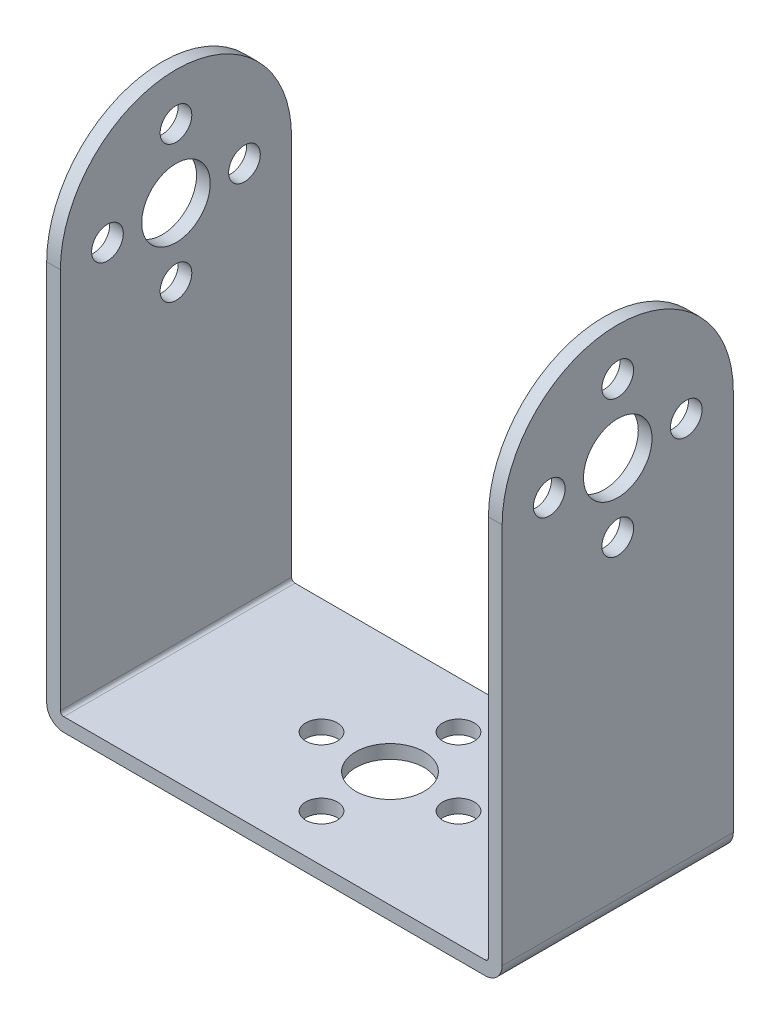
ISO-10303-21;
HEADER;
FILE_DESCRIPTION(('STEP AP214'),'2;1');
FILE_NAME('part.step','',(''),(''),'','','');
FILE_SCHEMA(('AUTOMOTIVE_DESIGN { 1 0 10303 214 1 1 1 1 }'));
ENDSEC;
DATA;
#1=APPLICATION_CONTEXT('core data for automotive mechanical design processes');
#2=APPLICATION_PROTOCOL_DEFINITION('international standard','automotive_design',2000,#1);
#3=PRODUCT_CONTEXT('',#1,'mechanical');
#4=PRODUCT('Part','Part','',(#3));
#5=PRODUCT_RELATED_PRODUCT_CATEGORY('part','',(#4));
#6=PRODUCT_DEFINITION_FORMATION('','',#4);
#7=PRODUCT_DEFINITION_CONTEXT('part definition',#1,'design');
#8=PRODUCT_DEFINITION('design','',#6,#7);
#9=PRODUCT_DEFINITION_SHAPE('','',#8);
#10=(LENGTH_UNIT() NAMED_UNIT(*) SI_UNIT(.MILLI.,.METRE.));
#11=(NAMED_UNIT(*) PLANE_ANGLE_UNIT() SI_UNIT($,.RADIAN.));
#12=(NAMED_UNIT(*) SI_UNIT($,.STERADIAN.) SOLID_ANGLE_UNIT());
#13=UNCERTAINTY_MEASURE_WITH_UNIT(LENGTH_MEASURE(1.E-05),#10,'distance_accuracy_value','');
#14=(GEOMETRIC_REPRESENTATION_CONTEXT(3) GLOBAL_UNCERTAINTY_ASSIGNED_CONTEXT((#13)) GLOBAL_UNIT_ASSIGNED_CONTEXT((#10,
#11,#12)) REPRESENTATION_CONTEXT('',''));
#15=CARTESIAN_POINT('',(0.,0.,0.));
#16=DIRECTION('',(0.,0.,1.));
#17=DIRECTION('',(1.,0.,0.));
#18=AXIS2_PLACEMENT_3D('',#15,#16,#17);
#19=CARTESIAN_POINT('',(-24.6,0.4,-48.6972));
#20=DIRECTION('',(0.,0.,1.));
#21=DIRECTION('',(1.,0.,0.));
#22=AXIS2_PLACEMENT_3D('',#19,#20,#21);
#23=CYLINDRICAL_SURFACE('',#22,0.4);
#24=CARTESIAN_POINT('',(-24.6,0.4,13.5));
#25=DIRECTION('',(0.,0.,1.));
#26=DIRECTION('',(1.,0.,0.));
#27=AXIS2_PLACEMENT_3D('',#24,#25,#26);
#28=CIRCLE('',#27,0.4);
#29=CARTESIAN_POINT('',(-24.6,0.,13.5));
#30=VERTEX_POINT('',#29);
#31=CARTESIAN_POINT('',(-25.,0.4,13.5));
#32=VERTEX_POINT('',#31);
#33=EDGE_CURVE('E114',#30,#32,#28,.F.);
#34=ORIENTED_EDGE('',*,*,#33,.F.);
#35=DIRECTION('',(0.,0.,1.));
#36=VECTOR('',#35,1.);
#37=CARTESIAN_POINT('',(-24.6,0.,-13.5));
#38=LINE('',#37,#36);
#39=CARTESIAN_POINT('',(-24.6,0.,-13.5));
#40=VERTEX_POINT('',#39);
#41=EDGE_CURVE('E116',#40,#30,#38,.T.);
#42=ORIENTED_EDGE('',*,*,#41,.F.);
#43=CARTESIAN_POINT('',(-24.6,0.4,-13.5));
#44=DIRECTION('',(0.,0.,1.));
#45=DIRECTION('',(1.,0.,0.));
#46=AXIS2_PLACEMENT_3D('',#43,#44,#45);
#47=CIRCLE('',#46,0.4);
#48=CARTESIAN_POINT('',(-25.,0.4,-13.5));
#49=VERTEX_POINT('',#48);
#50=EDGE_CURVE('E20',#49,#40,#47,.T.);
#51=ORIENTED_EDGE('',*,*,#50,.F.);
#52=DIRECTION('',(0.,0.,-1.));
#53=VECTOR('',#52,1.);
#54=CARTESIAN_POINT('',(-25.,0.4,-13.5));
#55=LINE('',#54,#53);
#56=EDGE_CURVE('E143',#32,#49,#55,.T.);
#57=ORIENTED_EDGE('',*,*,#56,.F.);
#58=EDGE_LOOP('',(#34,#42,#51,#57));
#59=FACE_BOUND('',#58,.T.);
#60=ADVANCED_FACE('F17',(#59),#23,.F.);
#61=CARTESIAN_POINT('',(95.95152,45.,0.));
#62=DIRECTION('',(-1.,0.,0.));
#63=DIRECTION('',(0.,0.,1.));
#64=AXIS2_PLACEMENT_3D('',#61,#62,#63);
#65=CYLINDRICAL_SURFACE('',#64,13.5);
#66=CARTESIAN_POINT('',(-25.,45.,0.));
#67=DIRECTION('',(-1.,0.,0.));
#68=DIRECTION('',(0.,0.,1.));
#69=AXIS2_PLACEMENT_3D('',#66,#67,#68);
#70=CIRCLE('',#69,13.5);
#71=CARTESIAN_POINT('',(-25.,45.,-13.5));
#72=VERTEX_POINT('',#71);
#73=CARTESIAN_POINT('',(-25.,45.,13.5));
#74=VERTEX_POINT('',#73);
#75=EDGE_CURVE('E145',#72,#74,#70,.F.);
#76=ORIENTED_EDGE('',*,*,#75,.F.);
#77=DIRECTION('',(-1.,0.,0.));
#78=VECTOR('',#77,1.);
#79=CARTESIAN_POINT('',(95.95152,45.,-13.5));
#80=LINE('',#79,#78);
#81=CARTESIAN_POINT('',(-26.6,45.,-13.5));
#82=VERTEX_POINT('',#81);
#83=EDGE_CURVE('E155',#72,#82,#80,.T.);
#84=ORIENTED_EDGE('',*,*,#83,.T.);
#85=CARTESIAN_POINT('',(-26.6,45.,0.));
#86=DIRECTION('',(-1.,0.,0.));
#87=DIRECTION('',(0.,0.,1.));
#88=AXIS2_PLACEMENT_3D('',#85,#86,#87);
#89=CIRCLE('',#88,13.5);
#90=CARTESIAN_POINT('',(-26.6,45.,13.5));
#91=VERTEX_POINT('',#90);
#92=EDGE_CURVE('E235',#91,#82,#89,.T.);
#93=ORIENTED_EDGE('',*,*,#92,.F.);
#94=DIRECTION('',(-1.,0.,0.));
#95=VECTOR('',#94,1.);
#96=CARTESIAN_POINT('',(95.95152,45.,13.5));
#97=LINE('',#96,#95);
#98=EDGE_CURVE('E158',#91,#74,#97,.F.);
#99=ORIENTED_EDGE('',*,*,#98,.T.);
#100=EDGE_LOOP('',(#76,#84,#93,#99));
#101=FACE_BOUND('',#100,.T.);
#102=ADVANCED_FACE('F429',(#101),#65,.T.);
#103=CARTESIAN_POINT('',(-31.92,45.,0.));
#104=DIRECTION('',(1.,0.,0.));
#105=DIRECTION('',(0.,0.,-1.));
#106=AXIS2_PLACEMENT_3D('',#103,#104,#105);
#107=CYLINDRICAL_SURFACE('',#106,4.);
#108=CARTESIAN_POINT('',(-25.,45.,0.));
#109=DIRECTION('',(1.,0.,0.));
#110=DIRECTION('',(0.,0.,-1.));
#111=AXIS2_PLACEMENT_3D('',#108,#109,#110);
#112=CIRCLE('',#111,4.);
#113=CARTESIAN_POINT('',(-25.,45.,-4.));
#114=VERTEX_POINT('',#113);
#115=EDGE_CURVE('E250',#114,#114,#112,.F.);
#116=ORIENTED_EDGE('',*,*,#115,.F.);
#117=EDGE_LOOP('',(#116));
#118=FACE_BOUND('',#117,.T.);
#119=CARTESIAN_POINT('',(-26.6,45.,0.));
#120=DIRECTION('',(1.,0.,0.));
#121=DIRECTION('',(0.,0.,-1.));
#122=AXIS2_PLACEMENT_3D('',#119,#120,#121);
#123=CIRCLE('',#122,4.);
#124=CARTESIAN_POINT('',(-26.6,45.,-4.));
#125=VERTEX_POINT('',#124);
#126=EDGE_CURVE('E232',#125,#125,#123,.T.);
#127=ORIENTED_EDGE('',*,*,#126,.F.);
#128=EDGE_LOOP('',(#127));
#129=FACE_BOUND('',#128,.T.);
#130=ADVANCED_FACE('F426',(#118,#129),#107,.F.);
#131=CARTESIAN_POINT('',(-31.92,53.,0.));
#132=DIRECTION('',(1.,0.,0.));
#133=DIRECTION('',(0.,0.,-1.));
#134=AXIS2_PLACEMENT_3D('',#131,#132,#133);
#135=CYLINDRICAL_SURFACE('',#134,1.85);
#136=CARTESIAN_POINT('',(-25.,53.,0.));
#137=DIRECTION('',(1.,0.,0.));
#138=DIRECTION('',(0.,0.,-1.));
#139=AXIS2_PLACEMENT_3D('',#136,#137,#138);
#140=CIRCLE('',#139,1.85);
#141=CARTESIAN_POINT('',(-25.,53.,-1.85));
#142=VERTEX_POINT('',#141);
#143=EDGE_CURVE('E247',#142,#142,#140,.F.);
#144=ORIENTED_EDGE('',*,*,#143,.F.);
#145=EDGE_LOOP('',(#144));
#146=FACE_BOUND('',#145,.T.);
#147=CARTESIAN_POINT('',(-26.6,53.,0.));
#148=DIRECTION('',(1.,0.,0.));
#149=DIRECTION('',(0.,0.,-1.));
#150=AXIS2_PLACEMENT_3D('',#147,#148,#149);
#151=CIRCLE('',#150,1.85);
#152=CARTESIAN_POINT('',(-26.6,53.,-1.85));
#153=VERTEX_POINT('',#152);
#154=EDGE_CURVE('E229',#153,#153,#151,.T.);
#155=ORIENTED_EDGE('',*,*,#154,.F.);
#156=EDGE_LOOP('',(#155));
#157=FACE_BOUND('',#156,.T.);
#158=ADVANCED_FACE('F422',(#146,#157),#135,.F.);
#159=CARTESIAN_POINT('',(-31.92,45.,-8.));
#160=DIRECTION('',(1.,0.,0.));
#161=DIRECTION('',(0.,0.,-1.));
#162=AXIS2_PLACEMENT_3D('',#159,#160,#161);
#163=CYLINDRICAL_SURFACE('',#162,1.85);
#164=CARTESIAN_POINT('',(-25.,45.,-8.));
#165=DIRECTION('',(1.,0.,0.));
#166=DIRECTION('',(0.,0.,-1.));
#167=AXIS2_PLACEMENT_3D('',#164,#165,#166);
#168=CIRCLE('',#167,1.85);
#169=CARTESIAN_POINT('',(-25.,45.,-9.85));
#170=VERTEX_POINT('',#169);
#171=EDGE_CURVE('E244',#170,#170,#168,.F.);
#172=ORIENTED_EDGE('',*,*,#171,.F.);
#173=EDGE_LOOP('',(#172));
#174=FACE_BOUND('',#173,.T.);
#175=CARTESIAN_POINT('',(-26.6,45.,-8.));
#176=DIRECTION('',(1.,0.,0.));
#177=DIRECTION('',(0.,0.,-1.));
#178=AXIS2_PLACEMENT_3D('',#175,#176,#177);
#179=CIRCLE('',#178,1.85);
#180=CARTESIAN_POINT('',(-26.6,45.,-9.85));
#181=VERTEX_POINT('',#180);
#182=EDGE_CURVE('E226',#181,#181,#179,.T.);
#183=ORIENTED_EDGE('',*,*,#182,.F.);
#184=EDGE_LOOP('',(#183));
#185=FACE_BOUND('',#184,.T.);
#186=ADVANCED_FACE('F418',(#174,#185),#163,.F.);
#187=CARTESIAN_POINT('',(-31.92,37.,0.));
#188=DIRECTION('',(1.,0.,0.));
#189=DIRECTION('',(0.,0.,-1.));
#190=AXIS2_PLACEMENT_3D('',#187,#188,#189);
#191=CYLINDRICAL_SURFACE('',#190,1.85);
#192=CARTESIAN_POINT('',(-25.,37.,0.));
#193=DIRECTION('',(1.,0.,0.));
#194=DIRECTION('',(0.,0.,-1.));
#195=AXIS2_PLACEMENT_3D('',#192,#193,#194);
#196=CIRCLE('',#195,1.85);
#197=CARTESIAN_POINT('',(-25.,37.,-1.85));
#198=VERTEX_POINT('',#197);
#199=EDGE_CURVE('E241',#198,#198,#196,.F.);
#200=ORIENTED_EDGE('',*,*,#199,.F.);
#201=EDGE_LOOP('',(#200));
#202=FACE_BOUND('',#201,.T.);
#203=CARTESIAN_POINT('',(-26.6,37.,0.));
#204=DIRECTION('',(1.,0.,0.));
#205=DIRECTION('',(0.,0.,-1.));
#206=AXIS2_PLACEMENT_3D('',#203,#204,#205);
#207=CIRCLE('',#206,1.85);
#208=CARTESIAN_POINT('',(-26.6,37.,-1.85));
#209=VERTEX_POINT('',#208);
#210=EDGE_CURVE('E223',#209,#209,#207,.T.);
#211=ORIENTED_EDGE('',*,*,#210,.F.);
#212=EDGE_LOOP('',(#211));
#213=FACE_BOUND('',#212,.T.);
#214=ADVANCED_FACE('F414',(#202,#213),#191,.F.);
#215=CARTESIAN_POINT('',(-31.92,45.,8.));
#216=DIRECTION('',(1.,0.,0.));
#217=DIRECTION('',(0.,0.,-1.));
#218=AXIS2_PLACEMENT_3D('',#215,#216,#217);
#219=CYLINDRICAL_SURFACE('',#218,1.85);
#220=CARTESIAN_POINT('',(-25.,45.,8.));
#221=DIRECTION('',(1.,0.,0.));
#222=DIRECTION('',(0.,0.,-1.));
#223=AXIS2_PLACEMENT_3D('',#220,#221,#222);
#224=CIRCLE('',#223,1.85);
#225=CARTESIAN_POINT('',(-25.,45.,6.15));
#226=VERTEX_POINT('',#225);
#227=EDGE_CURVE('E238',#226,#226,#224,.F.);
#228=ORIENTED_EDGE('',*,*,#227,.F.);
#229=EDGE_LOOP('',(#228));
#230=FACE_BOUND('',#229,.T.);
#231=CARTESIAN_POINT('',(-26.6,45.,8.));
#232=DIRECTION('',(1.,0.,0.));
#233=DIRECTION('',(0.,0.,-1.));
#234=AXIS2_PLACEMENT_3D('',#231,#232,#233);
#235=CIRCLE('',#234,1.85);
#236=CARTESIAN_POINT('',(-26.6,45.,6.15));
#237=VERTEX_POINT('',#236);
#238=EDGE_CURVE('E142',#237,#237,#235,.T.);
#239=ORIENTED_EDGE('',*,*,#238,.F.);
#240=EDGE_LOOP('',(#239));
#241=FACE_BOUND('',#240,.T.);
#242=ADVANCED_FACE('F410',(#230,#241),#219,.F.);
#243=CARTESIAN_POINT('',(0.,0.,0.));
#244=DIRECTION('',(0.,1.,0.));
#245=DIRECTION('',(0.,0.,1.));
#246=AXIS2_PLACEMENT_3D('',#243,#244,#245);
#247=CYLINDRICAL_SURFACE('',#246,4.);
#248=CARTESIAN_POINT('',(0.,-1.6,0.));
#249=DIRECTION('',(0.,1.,0.));
#250=DIRECTION('',(0.,0.,1.));
#251=AXIS2_PLACEMENT_3D('',#248,#249,#250);
#252=CIRCLE('',#251,4.);
#253=CARTESIAN_POINT('',(0.,-1.6,4.));
#254=VERTEX_POINT('',#253);
#255=EDGE_CURVE('E138',#254,#254,#252,.T.);
#256=ORIENTED_EDGE('',*,*,#255,.F.);
#257=EDGE_LOOP('',(#256));
#258=FACE_BOUND('',#257,.T.);
#259=CARTESIAN_POINT('',(0.,0.,0.));
#260=DIRECTION('',(0.,1.,0.));
#261=DIRECTION('',(0.,0.,1.));
#262=AXIS2_PLACEMENT_3D('',#259,#260,#261);
#263=CIRCLE('',#262,4.);
#264=CARTESIAN_POINT('',(0.,0.,4.));
#265=VERTEX_POINT('',#264);
#266=EDGE_CURVE('E147',#265,#265,#263,.F.);
#267=ORIENTED_EDGE('',*,*,#266,.F.);
#268=EDGE_LOOP('',(#267));
#269=FACE_BOUND('',#268,.T.);
#270=ADVANCED_FACE('F406',(#258,#269),#247,.F.);
#271=CARTESIAN_POINT('',(0.,0.,-8.));
#272=DIRECTION('',(0.,1.,0.));
#273=DIRECTION('',(0.,0.,1.));
#274=AXIS2_PLACEMENT_3D('',#271,#272,#273);
#275=CYLINDRICAL_SURFACE('',#274,1.85);
#276=CARTESIAN_POINT('',(0.,-1.6,-8.));
#277=DIRECTION('',(0.,1.,0.));
#278=DIRECTION('',(0.,0.,1.));
#279=AXIS2_PLACEMENT_3D('',#276,#277,#278);
#280=CIRCLE('',#279,1.85);
#281=CARTESIAN_POINT('',(0.,-1.6,-6.15));
#282=VERTEX_POINT('',#281);
#283=EDGE_CURVE('E216',#282,#282,#280,.T.);
#284=ORIENTED_EDGE('',*,*,#283,.F.);
#285=EDGE_LOOP('',(#284));
#286=FACE_BOUND('',#285,.T.);
#287=CARTESIAN_POINT('',(0.,0.,-8.));
#288=DIRECTION('',(0.,1.,0.));
#289=DIRECTION('',(0.,0.,1.));
#290=AXIS2_PLACEMENT_3D('',#287,#288,#289);
#291=CIRCLE('',#290,1.85);
#292=CARTESIAN_POINT('',(0.,0.,-6.15));
#293=VERTEX_POINT('',#292);
#294=EDGE_CURVE('E263',#293,#293,#291,.F.);
#295=ORIENTED_EDGE('',*,*,#294,.F.);
#296=EDGE_LOOP('',(#295));
#297=FACE_BOUND('',#296,.T.);
#298=ADVANCED_FACE('F402',(#286,#297),#275,.F.);
#299=CARTESIAN_POINT('',(8.,0.,0.));
#300=DIRECTION('',(0.,1.,0.));
#301=DIRECTION('',(0.,0.,1.));
#302=AXIS2_PLACEMENT_3D('',#299,#300,#301);
#303=CYLINDRICAL_SURFACE('',#302,1.85);
#304=CARTESIAN_POINT('',(8.,-1.6,0.));
#305=DIRECTION('',(0.,1.,0.));
#306=DIRECTION('',(0.,0.,1.));
#307=AXIS2_PLACEMENT_3D('',#304,#305,#306);
#308=CIRCLE('',#307,1.85);
#309=CARTESIAN_POINT('',(8.,-1.6,1.85));
#310=VERTEX_POINT('',#309);
#311=EDGE_CURVE('E213',#310,#310,#308,.T.);
#312=ORIENTED_EDGE('',*,*,#311,.F.);
#313=EDGE_LOOP('',(#312));
#314=FACE_BOUND('',#313,.T.);
#315=CARTESIAN_POINT('',(8.,0.,0.));
#316=DIRECTION('',(0.,1.,0.));
#317=DIRECTION('',(0.,0.,1.));
#318=AXIS2_PLACEMENT_3D('',#315,#316,#317);
#319=CIRCLE('',#318,1.85);
#320=CARTESIAN_POINT('',(8.,0.,1.85));
#321=VERTEX_POINT('',#320);
#322=EDGE_CURVE('E260',#321,#321,#319,.F.);
#323=ORIENTED_EDGE('',*,*,#322,.F.);
#324=EDGE_LOOP('',(#323));
#325=FACE_BOUND('',#324,.T.);
#326=ADVANCED_FACE('F398',(#314,#325),#303,.F.);
#327=CARTESIAN_POINT('',(0.,0.,8.));
#328=DIRECTION('',(0.,1.,0.));
#329=DIRECTION('',(0.,0.,1.));
#330=AXIS2_PLACEMENT_3D('',#327,#328,#329);
#331=CYLINDRICAL_SURFACE('',#330,1.85);
#332=CARTESIAN_POINT('',(0.,-1.6,8.));
#333=DIRECTION('',(0.,1.,0.));
#334=DIRECTION('',(0.,0.,1.));
#335=AXIS2_PLACEMENT_3D('',#332,#333,#334);
#336=CIRCLE('',#335,1.85);
#337=CARTESIAN_POINT('',(0.,-1.6,9.85));
#338=VERTEX_POINT('',#337);
#339=EDGE_CURVE('E210',#338,#338,#336,.T.);
#340=ORIENTED_EDGE('',*,*,#339,.F.);
#341=EDGE_LOOP('',(#340));
#342=FACE_BOUND('',#341,.T.);
#343=CARTESIAN_POINT('',(0.,0.,8.));
#344=DIRECTION('',(0.,1.,0.));
#345=DIRECTION('',(0.,0.,1.));
#346=AXIS2_PLACEMENT_3D('',#343,#344,#345);
#347=CIRCLE('',#346,1.85);
#348=CARTESIAN_POINT('',(0.,0.,9.85));
#349=VERTEX_POINT('',#348);
#350=EDGE_CURVE('E257',#349,#349,#347,.F.);
#351=ORIENTED_EDGE('',*,*,#350,.F.);
#352=EDGE_LOOP('',(#351));
#353=FACE_BOUND('',#352,.T.);
#354=ADVANCED_FACE('F394',(#342,#353),#331,.F.);
#355=CARTESIAN_POINT('',(-8.,0.,0.));
#356=DIRECTION('',(0.,1.,0.));
#357=DIRECTION('',(0.,0.,1.));
#358=AXIS2_PLACEMENT_3D('',#355,#356,#357);
#359=CYLINDRICAL_SURFACE('',#358,1.85);
#360=CARTESIAN_POINT('',(-8.,-1.6,0.));
#361=DIRECTION('',(0.,1.,0.));
#362=DIRECTION('',(0.,0.,1.));
#363=AXIS2_PLACEMENT_3D('',#360,#361,#362);
#364=CIRCLE('',#363,1.85);
#365=CARTESIAN_POINT('',(-8.,-1.6,1.85));
#366=VERTEX_POINT('',#365);
#367=EDGE_CURVE('E152',#366,#366,#364,.T.);
#368=ORIENTED_EDGE('',*,*,#367,.F.);
#369=EDGE_LOOP('',(#368));
#370=FACE_BOUND('',#369,.T.);
#371=CARTESIAN_POINT('',(-8.,0.,0.));
#372=DIRECTION('',(0.,1.,0.));
#373=DIRECTION('',(0.,0.,1.));
#374=AXIS2_PLACEMENT_3D('',#371,#372,#373);
#375=CIRCLE('',#374,1.85);
#376=CARTESIAN_POINT('',(-8.,0.,1.85));
#377=VERTEX_POINT('',#376);
#378=EDGE_CURVE('E146',#377,#377,#375,.F.);
#379=ORIENTED_EDGE('',*,*,#378,.F.);
#380=EDGE_LOOP('',(#379));
#381=FACE_BOUND('',#380,.T.);
#382=ADVANCED_FACE('F391',(#370,#381),#359,.F.);
#383=CARTESIAN_POINT('',(24.6,0.4,-48.6972));
#384=DIRECTION('',(0.,0.,1.));
#385=DIRECTION('',(1.,0.,0.));
#386=AXIS2_PLACEMENT_3D('',#383,#384,#385);
#387=CYLINDRICAL_SURFACE('',#386,0.4);
#388=CARTESIAN_POINT('',(24.6,0.4,13.5));
#389=DIRECTION('',(0.,0.,1.));
#390=DIRECTION('',(1.,0.,0.));
#391=AXIS2_PLACEMENT_3D('',#388,#389,#390);
#392=CIRCLE('',#391,0.4);
#393=CARTESIAN_POINT('',(25.,0.399999999999999,13.5));
#394=VERTEX_POINT('',#393);
#395=CARTESIAN_POINT('',(24.6,0.,13.5));
#396=VERTEX_POINT('',#395);
#397=EDGE_CURVE('E121',#394,#396,#392,.F.);
#398=ORIENTED_EDGE('',*,*,#397,.F.);
#399=DIRECTION('',(0.,0.,1.));
#400=VECTOR('',#399,1.);
#401=CARTESIAN_POINT('',(25.,0.399999999999998,-13.5));
#402=LINE('',#401,#400);
#403=CARTESIAN_POINT('',(25.,0.399999999999999,-13.5));
#404=VERTEX_POINT('',#403);
#405=EDGE_CURVE('E149',#404,#394,#402,.T.);
#406=ORIENTED_EDGE('',*,*,#405,.F.);
#407=CARTESIAN_POINT('',(24.6,0.4,-13.5));
#408=DIRECTION('',(0.,0.,1.));
#409=DIRECTION('',(1.,0.,0.));
#410=AXIS2_PLACEMENT_3D('',#407,#408,#409);
#411=CIRCLE('',#410,0.4);
#412=CARTESIAN_POINT('',(24.6,0.,-13.5));
#413=VERTEX_POINT('',#412);
#414=EDGE_CURVE('E157',#413,#404,#411,.T.);
#415=ORIENTED_EDGE('',*,*,#414,.F.);
#416=DIRECTION('',(0.,0.,1.));
#417=VECTOR('',#416,1.);
#418=CARTESIAN_POINT('',(24.6,0.,-13.5));
#419=LINE('',#418,#417);
#420=EDGE_CURVE('E120',#396,#413,#419,.F.);
#421=ORIENTED_EDGE('',*,*,#420,.F.);
#422=EDGE_LOOP('',(#398,#406,#415,#421));
#423=FACE_BOUND('',#422,.T.);
#424=ADVANCED_FACE('F322',(#423),#387,.F.);
#425=CARTESIAN_POINT('',(25.,0.,-13.5));
#426=DIRECTION('',(0.,1.,0.));
#427=DIRECTION('',(0.,0.,1.));
#428=AXIS2_PLACEMENT_3D('',#425,#426,#427);
#429=PLANE('',#428);
#430=ORIENTED_EDGE('',*,*,#378,.T.);
#431=EDGE_LOOP('',(#430));
#432=FACE_BOUND('',#431,.T.);
#433=ORIENTED_EDGE('',*,*,#350,.T.);
#434=EDGE_LOOP('',(#433));
#435=FACE_BOUND('',#434,.T.);
#436=ORIENTED_EDGE('',*,*,#322,.T.);
#437=EDGE_LOOP('',(#436));
#438=FACE_BOUND('',#437,.T.);
#439=ORIENTED_EDGE('',*,*,#294,.T.);
#440=EDGE_LOOP('',(#439));
#441=FACE_BOUND('',#440,.T.);
#442=ORIENTED_EDGE('',*,*,#266,.T.);
#443=EDGE_LOOP('',(#442));
#444=FACE_BOUND('',#443,.T.);
#445=ORIENTED_EDGE('',*,*,#420,.T.);
#446=DIRECTION('',(1.,0.,0.));
#447=VECTOR('',#446,1.);
#448=CARTESIAN_POINT('',(0.,0.,-13.5));
#449=LINE('',#448,#447);
#450=EDGE_CURVE('E111',#413,#40,#449,.F.);
#451=ORIENTED_EDGE('',*,*,#450,.T.);
#452=ORIENTED_EDGE('',*,*,#41,.T.);
#453=DIRECTION('',(1.,0.,0.));
#454=VECTOR('',#453,1.);
#455=CARTESIAN_POINT('',(0.,0.,13.5));
#456=LINE('',#455,#454);
#457=EDGE_CURVE('E274',#396,#30,#456,.F.);
#458=ORIENTED_EDGE('',*,*,#457,.F.);
#459=EDGE_LOOP('',(#445,#451,#452,#458));
#460=FACE_BOUND('',#459,.T.);
#461=ADVANCED_FACE('F124',(#432,#435,#438,#441,#444,#460),#429,.T.);
#462=CARTESIAN_POINT('',(-25.,0.,-13.5));
#463=DIRECTION('',(1.,0.,0.));
#464=DIRECTION('',(0.,0.,-1.));
#465=AXIS2_PLACEMENT_3D('',#462,#463,#464);
#466=PLANE('',#465);
#467=ORIENTED_EDGE('',*,*,#227,.T.);
#468=EDGE_LOOP('',(#467));
#469=FACE_BOUND('',#468,.T.);
#470=ORIENTED_EDGE('',*,*,#199,.T.);
#471=EDGE_LOOP('',(#470));
#472=FACE_BOUND('',#471,.T.);
#473=ORIENTED_EDGE('',*,*,#171,.T.);
#474=EDGE_LOOP('',(#473));
#475=FACE_BOUND('',#474,.T.);
#476=ORIENTED_EDGE('',*,*,#143,.T.);
#477=EDGE_LOOP('',(#476));
#478=FACE_BOUND('',#477,.T.);
#479=ORIENTED_EDGE('',*,*,#115,.T.);
#480=EDGE_LOOP('',(#479));
#481=FACE_BOUND('',#480,.T.);
#482=ORIENTED_EDGE('',*,*,#75,.T.);
#483=DIRECTION('',(0.,1.,0.));
#484=VECTOR('',#483,1.);
#485=CARTESIAN_POINT('',(-25.,0.,13.5));
#486=LINE('',#485,#484);
#487=EDGE_CURVE('E273',#32,#74,#486,.T.);
#488=ORIENTED_EDGE('',*,*,#487,.F.);
#489=ORIENTED_EDGE('',*,*,#56,.T.);
#490=DIRECTION('',(0.,1.,0.));
#491=VECTOR('',#490,1.);
#492=CARTESIAN_POINT('',(-25.,0.,-13.5));
#493=LINE('',#492,#491);
#494=EDGE_CURVE('E113',#49,#72,#493,.T.);
#495=ORIENTED_EDGE('',*,*,#494,.T.);
#496=EDGE_LOOP('',(#482,#488,#489,#495));
#497=FACE_BOUND('',#496,.T.);
#498=ADVANCED_FACE('F276',(#469,#472,#475,#478,#481,#497),#466,.T.);
#499=CARTESIAN_POINT('',(-26.6,58.5,-13.5));
#500=DIRECTION('',(-1.,0.,0.));
#501=DIRECTION('',(0.,0.,1.));
#502=AXIS2_PLACEMENT_3D('',#499,#500,#501);
#503=PLANE('',#502);
#504=ORIENTED_EDGE('',*,*,#238,.T.);
#505=EDGE_LOOP('',(#504));
#506=FACE_BOUND('',#505,.T.);
#507=ORIENTED_EDGE('',*,*,#210,.T.);
#508=EDGE_LOOP('',(#507));
#509=FACE_BOUND('',#508,.T.);
#510=ORIENTED_EDGE('',*,*,#182,.T.);
#511=EDGE_LOOP('',(#510));
#512=FACE_BOUND('',#511,.T.);
#513=ORIENTED_EDGE('',*,*,#154,.T.);
#514=EDGE_LOOP('',(#513));
#515=FACE_BOUND('',#514,.T.);
#516=ORIENTED_EDGE('',*,*,#126,.T.);
#517=EDGE_LOOP('',(#516));
#518=FACE_BOUND('',#517,.T.);
#519=ORIENTED_EDGE('',*,*,#92,.T.);
#520=DIRECTION('',(0.,1.,0.));
#521=VECTOR('',#520,1.);
#522=CARTESIAN_POINT('',(-26.6,0.,-13.5));
#523=LINE('',#522,#521);
#524=CARTESIAN_POINT('',(-26.6,0.399999999999999,-13.5));
#525=VERTEX_POINT('',#524);
#526=EDGE_CURVE('E128',#82,#525,#523,.F.);
#527=ORIENTED_EDGE('',*,*,#526,.T.);
#528=DIRECTION('',(0.,0.,-1.));
#529=VECTOR('',#528,1.);
#530=CARTESIAN_POINT('',(-26.6,0.399999999999998,48.6972));
#531=LINE('',#530,#529);
#532=CARTESIAN_POINT('',(-26.6,0.399999999999999,13.5));
#533=VERTEX_POINT('',#532);
#534=EDGE_CURVE('E139',#533,#525,#531,.T.);
#535=ORIENTED_EDGE('',*,*,#534,.F.);
#536=DIRECTION('',(0.,1.,0.));
#537=VECTOR('',#536,1.);
#538=CARTESIAN_POINT('',(-26.6,0.,13.5));
#539=LINE('',#538,#537);
#540=EDGE_CURVE('E196',#91,#533,#539,.F.);
#541=ORIENTED_EDGE('',*,*,#540,.F.);
#542=EDGE_LOOP('',(#519,#527,#535,#541));
#543=FACE_BOUND('',#542,.T.);
#544=ADVANCED_FACE('F294',(#506,#509,#512,#515,#518,#543),#503,.T.);
#545=CARTESIAN_POINT('',(-24.6,0.4,48.6972));
#546=DIRECTION('',(0.,0.,-1.));
#547=DIRECTION('',(0.,1.,0.));
#548=AXIS2_PLACEMENT_3D('',#545,#546,#547);
#549=CYLINDRICAL_SURFACE('',#548,2.);
#550=CARTESIAN_POINT('',(-24.6,0.4,13.5));
#551=DIRECTION('',(0.,0.,-1.));
#552=DIRECTION('',(0.,1.,0.));
#553=AXIS2_PLACEMENT_3D('',#550,#551,#552);
#554=CIRCLE('',#553,2.);
#555=CARTESIAN_POINT('',(-24.6,-1.6,13.5));
#556=VERTEX_POINT('',#555);
#557=EDGE_CURVE('E193',#533,#556,#554,.F.);
#558=ORIENTED_EDGE('',*,*,#557,.F.);
#559=ORIENTED_EDGE('',*,*,#534,.T.);
#560=CARTESIAN_POINT('',(-24.6,0.4,-13.5));
#561=DIRECTION('',(0.,0.,-1.));
#562=DIRECTION('',(0.,1.,0.));
#563=AXIS2_PLACEMENT_3D('',#560,#561,#562);
#564=CIRCLE('',#563,2.);
#565=CARTESIAN_POINT('',(-24.6,-1.6,-13.5));
#566=VERTEX_POINT('',#565);
#567=EDGE_CURVE('E206',#525,#566,#564,.F.);
#568=ORIENTED_EDGE('',*,*,#567,.T.);
#569=DIRECTION('',(0.,0.,-1.));
#570=VECTOR('',#569,1.);
#571=CARTESIAN_POINT('',(-24.6,-1.6,-13.5));
#572=LINE('',#571,#570);
#573=EDGE_CURVE('E135',#556,#566,#572,.T.);
#574=ORIENTED_EDGE('',*,*,#573,.F.);
#575=EDGE_LOOP('',(#558,#559,#568,#574));
#576=FACE_BOUND('',#575,.T.);
#577=ADVANCED_FACE('F300',(#576),#549,.T.);
#578=CARTESIAN_POINT('',(-26.6,-1.6,-13.5));
#579=DIRECTION('',(0.,-1.,0.));
#580=DIRECTION('',(0.,0.,-1.));
#581=AXIS2_PLACEMENT_3D('',#578,#579,#580);
#582=PLANE('',#581);
#583=ORIENTED_EDGE('',*,*,#367,.T.);
#584=EDGE_LOOP('',(#583));
#585=FACE_BOUND('',#584,.T.);
#586=ORIENTED_EDGE('',*,*,#339,.T.);
#587=EDGE_LOOP('',(#586));
#588=FACE_BOUND('',#587,.T.);
#589=ORIENTED_EDGE('',*,*,#311,.T.);
#590=EDGE_LOOP('',(#589));
#591=FACE_BOUND('',#590,.T.);
#592=ORIENTED_EDGE('',*,*,#283,.T.);
#593=EDGE_LOOP('',(#592));
#594=FACE_BOUND('',#593,.T.);
#595=ORIENTED_EDGE('',*,*,#255,.T.);
#596=EDGE_LOOP('',(#595));
#597=FACE_BOUND('',#596,.T.);
#598=ORIENTED_EDGE('',*,*,#573,.T.);
#599=DIRECTION('',(1.,0.,0.));
#600=VECTOR('',#599,1.);
#601=CARTESIAN_POINT('',(0.,-1.6,-13.5));
#602=LINE('',#601,#600);
#603=CARTESIAN_POINT('',(24.6,-1.6,-13.5));
#604=VERTEX_POINT('',#603);
#605=EDGE_CURVE('E205',#566,#604,#602,.T.);
#606=ORIENTED_EDGE('',*,*,#605,.T.);
#607=DIRECTION('',(0.,0.,-1.));
#608=VECTOR('',#607,1.);
#609=CARTESIAN_POINT('',(24.6,-1.6,48.6972));
#610=LINE('',#609,#608);
#611=CARTESIAN_POINT('',(24.6,-1.6,13.5));
#612=VERTEX_POINT('',#611);
#613=EDGE_CURVE('E131',#612,#604,#610,.T.);
#614=ORIENTED_EDGE('',*,*,#613,.F.);
#615=DIRECTION('',(1.,0.,0.));
#616=VECTOR('',#615,1.);
#617=CARTESIAN_POINT('',(0.,-1.6,13.5));
#618=LINE('',#617,#616);
#619=EDGE_CURVE('E192',#556,#612,#618,.T.);
#620=ORIENTED_EDGE('',*,*,#619,.F.);
#621=EDGE_LOOP('',(#598,#606,#614,#620));
#622=FACE_BOUND('',#621,.T.);
#623=ADVANCED_FACE('F304',(#585,#588,#591,#594,#597,#622),#582,.T.);
#624=CARTESIAN_POINT('',(25.,58.5,-13.5));
#625=DIRECTION('',(-1.,0.,0.));
#626=DIRECTION('',(0.,0.,1.));
#627=AXIS2_PLACEMENT_3D('',#624,#625,#626);
#628=PLANE('',#627);
#629=CARTESIAN_POINT('',(25.,45.,8.));
#630=DIRECTION('',(1.,0.,0.));
#631=DIRECTION('',(0.,0.,-1.));
#632=AXIS2_PLACEMENT_3D('',#629,#630,#631);
#633=CIRCLE('',#632,1.85);
#634=CARTESIAN_POINT('',(25.,45.,6.15));
#635=VERTEX_POINT('',#634);
#636=EDGE_CURVE('E176',#635,#635,#633,.T.);
#637=ORIENTED_EDGE('',*,*,#636,.T.);
#638=EDGE_LOOP('',(#637));
#639=FACE_BOUND('',#638,.T.);
#640=CARTESIAN_POINT('',(25.,37.,0.));
#641=DIRECTION('',(1.,0.,0.));
#642=DIRECTION('',(0.,0.,-1.));
#643=AXIS2_PLACEMENT_3D('',#640,#641,#642);
#644=CIRCLE('',#643,1.85);
#645=CARTESIAN_POINT('',(25.,37.,-1.85));
#646=VERTEX_POINT('',#645);
#647=EDGE_CURVE('E180',#646,#646,#644,.T.);
#648=ORIENTED_EDGE('',*,*,#647,.T.);
#649=EDGE_LOOP('',(#648));
#650=FACE_BOUND('',#649,.T.);
#651=CARTESIAN_POINT('',(25.,45.,-8.));
#652=DIRECTION('',(1.,0.,0.));
#653=DIRECTION('',(0.,0.,-1.));
#654=AXIS2_PLACEMENT_3D('',#651,#652,#653);
#655=CIRCLE('',#654,1.85);
#656=CARTESIAN_POINT('',(25.,45.,-9.85));
#657=VERTEX_POINT('',#656);
#658=EDGE_CURVE('E183',#657,#657,#655,.T.);
#659=ORIENTED_EDGE('',*,*,#658,.T.);
#660=EDGE_LOOP('',(#659));
#661=FACE_BOUND('',#660,.T.);
#662=CARTESIAN_POINT('',(25.,53.,0.));
#663=DIRECTION('',(1.,0.,0.));
#664=DIRECTION('',(0.,0.,-1.));
#665=AXIS2_PLACEMENT_3D('',#662,#663,#664);
#666=CIRCLE('',#665,1.85);
#667=CARTESIAN_POINT('',(25.,53.,-1.85));
#668=VERTEX_POINT('',#667);
#669=EDGE_CURVE('E186',#668,#668,#666,.T.);
#670=ORIENTED_EDGE('',*,*,#669,.T.);
#671=EDGE_LOOP('',(#670));
#672=FACE_BOUND('',#671,.T.);
#673=CARTESIAN_POINT('',(25.,45.,0.));
#674=DIRECTION('',(1.,0.,0.));
#675=DIRECTION('',(0.,0.,-1.));
#676=AXIS2_PLACEMENT_3D('',#673,#674,#675);
#677=CIRCLE('',#676,4.);
#678=CARTESIAN_POINT('',(25.,45.,-4.));
#679=VERTEX_POINT('',#678);
#680=EDGE_CURVE('E189',#679,#679,#677,.T.);
#681=ORIENTED_EDGE('',*,*,#680,.T.);
#682=EDGE_LOOP('',(#681));
#683=FACE_BOUND('',#682,.T.);
#684=CARTESIAN_POINT('',(25.,45.,0.));
#685=DIRECTION('',(-1.,0.,0.));
#686=DIRECTION('',(0.,0.,1.));
#687=AXIS2_PLACEMENT_3D('',#684,#685,#686);
#688=CIRCLE('',#687,13.5);
#689=CARTESIAN_POINT('',(25.,45.,-13.5));
#690=VERTEX_POINT('',#689);
#691=CARTESIAN_POINT('',(25.,45.,13.5));
#692=VERTEX_POINT('',#691);
#693=EDGE_CURVE('E201',#690,#692,#688,.F.);
#694=ORIENTED_EDGE('',*,*,#693,.F.);
#695=DIRECTION('',(0.,1.,0.));
#696=VECTOR('',#695,1.);
#697=CARTESIAN_POINT('',(25.,0.,-13.5));
#698=LINE('',#697,#696);
#699=EDGE_CURVE('E126',#690,#404,#698,.F.);
#700=ORIENTED_EDGE('',*,*,#699,.T.);
#701=ORIENTED_EDGE('',*,*,#405,.T.);
#702=DIRECTION('',(0.,1.,0.));
#703=VECTOR('',#702,1.);
#704=CARTESIAN_POINT('',(25.,0.,13.5));
#705=LINE('',#704,#703);
#706=EDGE_CURVE('E281',#692,#394,#705,.F.);
#707=ORIENTED_EDGE('',*,*,#706,.F.);
#708=EDGE_LOOP('',(#694,#700,#701,#707));
#709=FACE_BOUND('',#708,.T.);
#710=ADVANCED_FACE('F318',(#639,#650,#661,#672,#683,#709),#628,.T.);
#711=CARTESIAN_POINT('',(24.6,0.4,48.6972));
#712=DIRECTION('',(0.,0.,-1.));
#713=DIRECTION('',(-1.,0.,0.));
#714=AXIS2_PLACEMENT_3D('',#711,#712,#713);
#715=CYLINDRICAL_SURFACE('',#714,2.);
#716=CARTESIAN_POINT('',(24.6,0.4,13.5));
#717=DIRECTION('',(0.,0.,-1.));
#718=DIRECTION('',(-1.,0.,0.));
#719=AXIS2_PLACEMENT_3D('',#716,#717,#718);
#720=CIRCLE('',#719,2.);
#721=CARTESIAN_POINT('',(26.6,0.4,13.5));
#722=VERTEX_POINT('',#721);
#723=EDGE_CURVE('E197',#612,#722,#720,.F.);
#724=ORIENTED_EDGE('',*,*,#723,.F.);
#725=ORIENTED_EDGE('',*,*,#613,.T.);
#726=CARTESIAN_POINT('',(24.6,0.4,-13.5));
#727=DIRECTION('',(0.,0.,-1.));
#728=DIRECTION('',(-1.,0.,0.));
#729=AXIS2_PLACEMENT_3D('',#726,#727,#728);
#730=CIRCLE('',#729,2.);
#731=CARTESIAN_POINT('',(26.6,0.4,-13.5));
#732=VERTEX_POINT('',#731);
#733=EDGE_CURVE('E203',#604,#732,#730,.F.);
#734=ORIENTED_EDGE('',*,*,#733,.T.);
#735=DIRECTION('',(0.,0.,-1.));
#736=VECTOR('',#735,1.);
#737=CARTESIAN_POINT('',(26.6,0.4,-13.5));
#738=LINE('',#737,#736);
#739=EDGE_CURVE('E179',#722,#732,#738,.T.);
#740=ORIENTED_EDGE('',*,*,#739,.F.);
#741=EDGE_LOOP('',(#724,#725,#734,#740));
#742=FACE_BOUND('',#741,.T.);
#743=ADVANCED_FACE('F308',(#742),#715,.T.);
#744=CARTESIAN_POINT('',(0.,0.,-13.5));
#745=DIRECTION('',(0.,0.,1.));
#746=DIRECTION('',(1.,0.,0.));
#747=AXIS2_PLACEMENT_3D('',#744,#745,#746);
#748=PLANE('',#747);
#749=ORIENTED_EDGE('',*,*,#605,.F.);
#750=ORIENTED_EDGE('',*,*,#567,.F.);
#751=ORIENTED_EDGE('',*,*,#526,.F.);
#752=ORIENTED_EDGE('',*,*,#83,.F.);
#753=ORIENTED_EDGE('',*,*,#494,.F.);
#754=ORIENTED_EDGE('',*,*,#50,.T.);
#755=ORIENTED_EDGE('',*,*,#450,.F.);
#756=ORIENTED_EDGE('',*,*,#414,.T.);
#757=ORIENTED_EDGE('',*,*,#699,.F.);
#758=DIRECTION('',(-1.,0.,0.));
#759=VECTOR('',#758,1.);
#760=CARTESIAN_POINT('',(95.95152,45.,-13.5));
#761=LINE('',#760,#759);
#762=CARTESIAN_POINT('',(26.6,45.,-13.5));
#763=VERTEX_POINT('',#762);
#764=EDGE_CURVE('E200',#763,#690,#761,.T.);
#765=ORIENTED_EDGE('',*,*,#764,.F.);
#766=DIRECTION('',(0.,1.,0.));
#767=VECTOR('',#766,1.);
#768=CARTESIAN_POINT('',(26.6,-1.6,-13.5));
#769=LINE('',#768,#767);
#770=EDGE_CURVE('E175',#732,#763,#769,.T.);
#771=ORIENTED_EDGE('',*,*,#770,.F.);
#772=ORIENTED_EDGE('',*,*,#733,.F.);
#773=EDGE_LOOP('',(#749,#750,#751,#752,#753,#754,#755,#756,#757,#765,#771,#772));
#774=FACE_BOUND('',#773,.T.);
#775=ADVANCED_FACE('F109',(#774),#748,.F.);
#776=CARTESIAN_POINT('',(95.95152,45.,0.));
#777=DIRECTION('',(-1.,0.,0.));
#778=DIRECTION('',(0.,0.,1.));
#779=AXIS2_PLACEMENT_3D('',#776,#777,#778);
#780=CYLINDRICAL_SURFACE('',#779,13.5);
#781=CARTESIAN_POINT('',(26.6,45.,0.));
#782=DIRECTION('',(-1.,0.,0.));
#783=DIRECTION('',(0.,0.,1.));
#784=AXIS2_PLACEMENT_3D('',#781,#782,#783);
#785=CIRCLE('',#784,13.5);
#786=CARTESIAN_POINT('',(26.6,45.,13.5));
#787=VERTEX_POINT('',#786);
#788=EDGE_CURVE('E172',#763,#787,#785,.F.);
#789=ORIENTED_EDGE('',*,*,#788,.F.);
#790=ORIENTED_EDGE('',*,*,#764,.T.);
#791=ORIENTED_EDGE('',*,*,#693,.T.);
#792=DIRECTION('',(1.,0.,0.));
#793=VECTOR('',#792,1.);
#794=CARTESIAN_POINT('',(0.,45.,13.5));
#795=LINE('',#794,#793);
#796=EDGE_CURVE('E35',#787,#692,#795,.F.);
#797=ORIENTED_EDGE('',*,*,#796,.F.);
#798=EDGE_LOOP('',(#789,#790,#791,#797));
#799=FACE_BOUND('',#798,.T.);
#800=ADVANCED_FACE('F323',(#799),#780,.T.);
#801=CARTESIAN_POINT('',(0.,0.,13.5));
#802=DIRECTION('',(0.,0.,1.));
#803=DIRECTION('',(1.,0.,0.));
#804=AXIS2_PLACEMENT_3D('',#801,#802,#803);
#805=PLANE('',#804);
#806=ORIENTED_EDGE('',*,*,#557,.T.);
#807=ORIENTED_EDGE('',*,*,#619,.T.);
#808=ORIENTED_EDGE('',*,*,#723,.T.);
#809=DIRECTION('',(0.,1.,0.));
#810=VECTOR('',#809,1.);
#811=CARTESIAN_POINT('',(26.6,-1.6,13.5));
#812=LINE('',#811,#810);
#813=EDGE_CURVE('E171',#787,#722,#812,.F.);
#814=ORIENTED_EDGE('',*,*,#813,.F.);
#815=ORIENTED_EDGE('',*,*,#796,.T.);
#816=ORIENTED_EDGE('',*,*,#706,.T.);
#817=ORIENTED_EDGE('',*,*,#397,.T.);
#818=ORIENTED_EDGE('',*,*,#457,.T.);
#819=ORIENTED_EDGE('',*,*,#33,.T.);
#820=ORIENTED_EDGE('',*,*,#487,.T.);
#821=ORIENTED_EDGE('',*,*,#98,.F.);
#822=ORIENTED_EDGE('',*,*,#540,.T.);
#823=EDGE_LOOP('',(#806,#807,#808,#814,#815,#816,#817,#818,#819,#820,#821,#822));
#824=FACE_BOUND('',#823,.T.);
#825=ADVANCED_FACE('F271',(#824),#805,.T.);
#826=CARTESIAN_POINT('',(-31.92,45.,0.));
#827=DIRECTION('',(1.,0.,0.));
#828=DIRECTION('',(0.,0.,-1.));
#829=AXIS2_PLACEMENT_3D('',#826,#827,#828);
#830=CYLINDRICAL_SURFACE('',#829,4.);
#831=ORIENTED_EDGE('',*,*,#680,.F.);
#832=EDGE_LOOP('',(#831));
#833=FACE_BOUND('',#832,.T.);
#834=CARTESIAN_POINT('',(26.6,45.,0.));
#835=DIRECTION('',(1.,0.,0.));
#836=DIRECTION('',(0.,0.,-1.));
#837=AXIS2_PLACEMENT_3D('',#834,#835,#836);
#838=CIRCLE('',#837,4.);
#839=CARTESIAN_POINT('',(26.6,45.,-4.));
#840=VERTEX_POINT('',#839);
#841=EDGE_CURVE('E168',#840,#840,#838,.F.);
#842=ORIENTED_EDGE('',*,*,#841,.F.);
#843=EDGE_LOOP('',(#842));
#844=FACE_BOUND('',#843,.T.);
#845=ADVANCED_FACE('F331',(#833,#844),#830,.F.);
#846=CARTESIAN_POINT('',(-31.92,53.,0.));
#847=DIRECTION('',(1.,0.,0.));
#848=DIRECTION('',(0.,0.,-1.));
#849=AXIS2_PLACEMENT_3D('',#846,#847,#848);
#850=CYLINDRICAL_SURFACE('',#849,1.85);
#851=ORIENTED_EDGE('',*,*,#669,.F.);
#852=EDGE_LOOP('',(#851));
#853=FACE_BOUND('',#852,.T.);
#854=CARTESIAN_POINT('',(26.6,53.,0.));
#855=DIRECTION('',(1.,0.,0.));
#856=DIRECTION('',(0.,0.,-1.));
#857=AXIS2_PLACEMENT_3D('',#854,#855,#856);
#858=CIRCLE('',#857,1.85);
#859=CARTESIAN_POINT('',(26.6,53.,-1.85));
#860=VERTEX_POINT('',#859);
#861=EDGE_CURVE('E165',#860,#860,#858,.F.);
#862=ORIENTED_EDGE('',*,*,#861,.F.);
#863=EDGE_LOOP('',(#862));
#864=FACE_BOUND('',#863,.T.);
#865=ADVANCED_FACE('F352',(#853,#864),#850,.F.);
#866=CARTESIAN_POINT('',(-31.92,45.,-8.));
#867=DIRECTION('',(1.,0.,0.));
#868=DIRECTION('',(0.,0.,-1.));
#869=AXIS2_PLACEMENT_3D('',#866,#867,#868);
#870=CYLINDRICAL_SURFACE('',#869,1.85);
#871=ORIENTED_EDGE('',*,*,#658,.F.);
#872=EDGE_LOOP('',(#871));
#873=FACE_BOUND('',#872,.T.);
#874=CARTESIAN_POINT('',(26.6,45.,-8.));
#875=DIRECTION('',(1.,0.,0.));
#876=DIRECTION('',(0.,0.,-1.));
#877=AXIS2_PLACEMENT_3D('',#874,#875,#876);
#878=CIRCLE('',#877,1.85);
#879=CARTESIAN_POINT('',(26.6,45.,-9.85));
#880=VERTEX_POINT('',#879);
#881=EDGE_CURVE('E162',#880,#880,#878,.F.);
#882=ORIENTED_EDGE('',*,*,#881,.F.);
#883=EDGE_LOOP('',(#882));
#884=FACE_BOUND('',#883,.T.);
#885=ADVANCED_FACE('F348',(#873,#884),#870,.F.);
#886=CARTESIAN_POINT('',(-31.92,37.,0.));
#887=DIRECTION('',(1.,0.,0.));
#888=DIRECTION('',(0.,0.,-1.));
#889=AXIS2_PLACEMENT_3D('',#886,#887,#888);
#890=CYLINDRICAL_SURFACE('',#889,1.85);
#891=ORIENTED_EDGE('',*,*,#647,.F.);
#892=EDGE_LOOP('',(#891));
#893=FACE_BOUND('',#892,.T.);
#894=CARTESIAN_POINT('',(26.6,37.,0.));
#895=DIRECTION('',(1.,0.,0.));
#896=DIRECTION('',(0.,0.,-1.));
#897=AXIS2_PLACEMENT_3D('',#894,#895,#896);
#898=CIRCLE('',#897,1.85);
#899=CARTESIAN_POINT('',(26.6,37.,-1.85));
#900=VERTEX_POINT('',#899);
#901=EDGE_CURVE('E26',#900,#900,#898,.F.);
#902=ORIENTED_EDGE('',*,*,#901,.F.);
#903=EDGE_LOOP('',(#902));
#904=FACE_BOUND('',#903,.T.);
#905=ADVANCED_FACE('F341',(#893,#904),#890,.F.);
#906=CARTESIAN_POINT('',(-31.92,45.,8.));
#907=DIRECTION('',(1.,0.,0.));
#908=DIRECTION('',(0.,0.,-1.));
#909=AXIS2_PLACEMENT_3D('',#906,#907,#908);
#910=CYLINDRICAL_SURFACE('',#909,1.85);
#911=ORIENTED_EDGE('',*,*,#636,.F.);
#912=EDGE_LOOP('',(#911));
#913=FACE_BOUND('',#912,.T.);
#914=CARTESIAN_POINT('',(26.6,45.,8.));
#915=DIRECTION('',(1.,0.,0.));
#916=DIRECTION('',(0.,0.,-1.));
#917=AXIS2_PLACEMENT_3D('',#914,#915,#916);
#918=CIRCLE('',#917,1.85);
#919=CARTESIAN_POINT('',(26.6,45.,6.15));
#920=VERTEX_POINT('',#919);
#921=EDGE_CURVE('E10',#920,#920,#918,.F.);
#922=ORIENTED_EDGE('',*,*,#921,.F.);
#923=EDGE_LOOP('',(#922));
#924=FACE_BOUND('',#923,.T.);
#925=ADVANCED_FACE('F335',(#913,#924),#910,.F.);
#926=CARTESIAN_POINT('',(26.6,-1.6,-13.5));
#927=DIRECTION('',(1.,0.,0.));
#928=DIRECTION('',(0.,0.,-1.));
#929=AXIS2_PLACEMENT_3D('',#926,#927,#928);
#930=PLANE('',#929);
#931=ORIENTED_EDGE('',*,*,#921,.T.);
#932=EDGE_LOOP('',(#931));
#933=FACE_BOUND('',#932,.T.);
#934=ORIENTED_EDGE('',*,*,#901,.T.);
#935=EDGE_LOOP('',(#934));
#936=FACE_BOUND('',#935,.T.);
#937=ORIENTED_EDGE('',*,*,#881,.T.);
#938=EDGE_LOOP('',(#937));
#939=FACE_BOUND('',#938,.T.);
#940=ORIENTED_EDGE('',*,*,#861,.T.);
#941=EDGE_LOOP('',(#940));
#942=FACE_BOUND('',#941,.T.);
#943=ORIENTED_EDGE('',*,*,#841,.T.);
#944=EDGE_LOOP('',(#943));
#945=FACE_BOUND('',#944,.T.);
#946=ORIENTED_EDGE('',*,*,#788,.T.);
#947=ORIENTED_EDGE('',*,*,#813,.T.);
#948=ORIENTED_EDGE('',*,*,#739,.T.);
#949=ORIENTED_EDGE('',*,*,#770,.T.);
#950=EDGE_LOOP('',(#946,#947,#948,#949));
#951=FACE_BOUND('',#950,.T.);
#952=ADVANCED_FACE('F315',(#933,#936,#939,#942,#945,#951),#930,.T.);
#953=CLOSED_SHELL('',(#60,#102,#130,#158,#186,#214,#242,#270,#298,#326,#354,#382,#424,#461,#498,
#544,#577,#623,#710,#743,#775,#800,#825,#845,#865,#885,#905,#925,#952));
#954=MANIFOLD_SOLID_BREP('B1',#953);
#955=ADVANCED_BREP_SHAPE_REPRESENTATION('',(#18,#954),#14);
#956=SHAPE_DEFINITION_REPRESENTATION(#9,#955);
ENDSEC;
END-ISO-10303-21;
